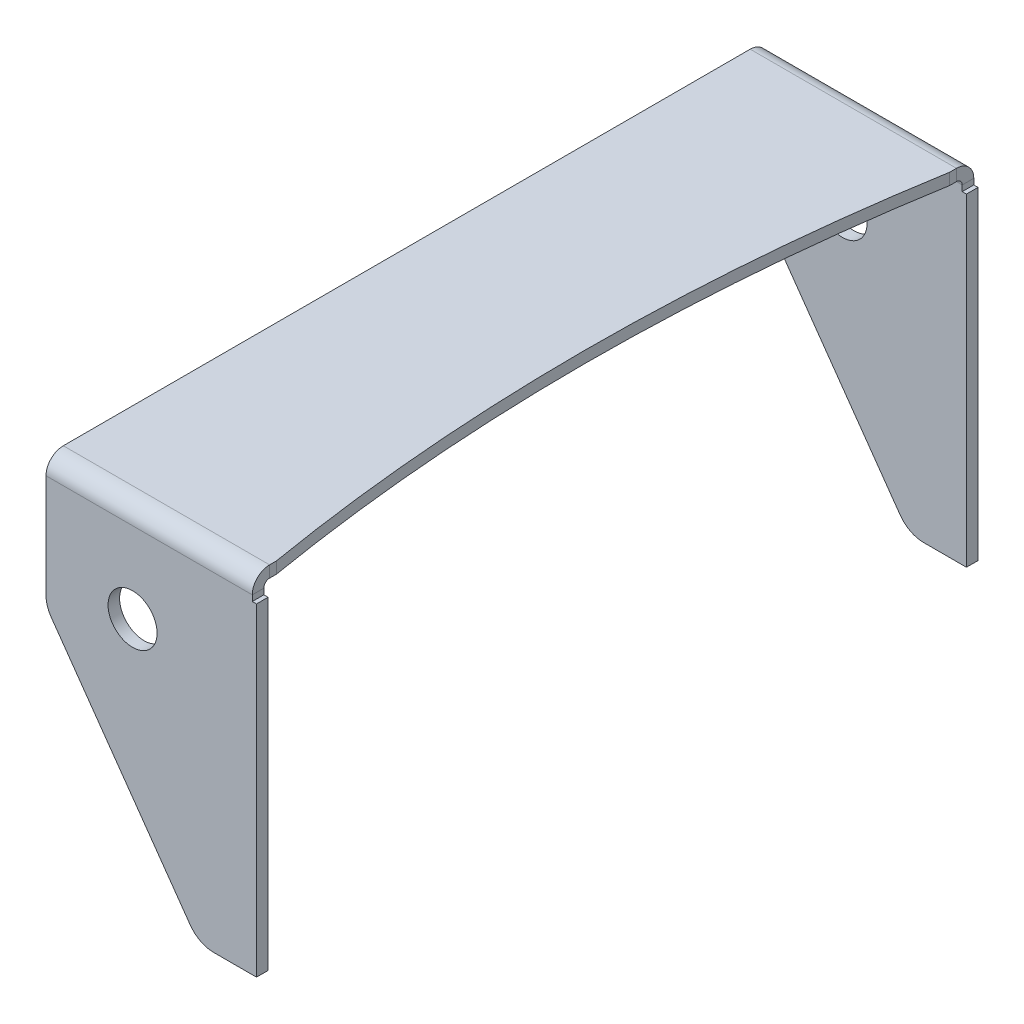
ISO-10303-21;
HEADER;
FILE_DESCRIPTION(('STEP AP214'),'2;1');
FILE_NAME('part.step','',(''),(''),'','','');
FILE_SCHEMA(('AUTOMOTIVE_DESIGN { 1 0 10303 214 1 1 1 1 }'));
ENDSEC;
DATA;
#1=APPLICATION_CONTEXT('core data for automotive mechanical design processes');
#2=APPLICATION_PROTOCOL_DEFINITION('international standard','automotive_design',2000,#1);
#3=PRODUCT_CONTEXT('',#1,'mechanical');
#4=PRODUCT('Part','Part','',(#3));
#5=PRODUCT_RELATED_PRODUCT_CATEGORY('part','',(#4));
#6=PRODUCT_DEFINITION_FORMATION('','',#4);
#7=PRODUCT_DEFINITION_CONTEXT('part definition',#1,'design');
#8=PRODUCT_DEFINITION('design','',#6,#7);
#9=PRODUCT_DEFINITION_SHAPE('','',#8);
#10=(LENGTH_UNIT() NAMED_UNIT(*) SI_UNIT(.MILLI.,.METRE.));
#11=(NAMED_UNIT(*) PLANE_ANGLE_UNIT() SI_UNIT($,.RADIAN.));
#12=(NAMED_UNIT(*) SI_UNIT($,.STERADIAN.) SOLID_ANGLE_UNIT());
#13=UNCERTAINTY_MEASURE_WITH_UNIT(LENGTH_MEASURE(1.E-05),#10,'distance_accuracy_value','');
#14=(GEOMETRIC_REPRESENTATION_CONTEXT(3) GLOBAL_UNCERTAINTY_ASSIGNED_CONTEXT((#13)) GLOBAL_UNIT_ASSIGNED_CONTEXT((#10,
#11,#12)) REPRESENTATION_CONTEXT('',''));
#15=CARTESIAN_POINT('',(0.,0.,0.));
#16=DIRECTION('',(0.,0.,1.));
#17=DIRECTION('',(1.,0.,0.));
#18=AXIS2_PLACEMENT_3D('',#15,#16,#17);
#19=CARTESIAN_POINT('',(-688.748865697796,4.44089209850063E-13,-121.000000000011));
#20=DIRECTION('',(-1.,0.,0.));
#21=DIRECTION('',(0.,1.,0.));
#22=AXIS2_PLACEMENT_3D('',#19,#20,#21);
#23=PLANE('',#22);
#24=DIRECTION('',(0.,-1.,0.));
#25=VECTOR('',#24,1.);
#26=CARTESIAN_POINT('',(-688.748865697796,4.44089209850063E-13,-125.000000000011));
#27=LINE('',#26,#25);
#28=CARTESIAN_POINT('',(-688.748865697796,3074.69999999999,-125.));
#29=VERTEX_POINT('',#28);
#30=CARTESIAN_POINT('',(-688.748865697796,2962.69999999999,-125.000000000001));
#31=VERTEX_POINT('',#30);
#32=EDGE_CURVE('E250',#29,#31,#27,.T.);
#33=ORIENTED_EDGE('',*,*,#32,.F.);
#34=DIRECTION('',(0.,0.,1.));
#35=VECTOR('',#34,1.);
#36=CARTESIAN_POINT('',(-688.748865697796,3074.69999999999,-121.));
#37=LINE('',#36,#35);
#38=CARTESIAN_POINT('',(-688.748865697796,3074.69999999999,-121.));
#39=VERTEX_POINT('',#38);
#40=EDGE_CURVE('E11',#39,#29,#37,.F.);
#41=ORIENTED_EDGE('',*,*,#40,.F.);
#42=DIRECTION('',(0.,1.,0.));
#43=VECTOR('',#42,1.);
#44=CARTESIAN_POINT('',(-688.748865697796,4.44089209850063E-13,-121.000000000011));
#45=LINE('',#44,#43);
#46=CARTESIAN_POINT('',(-688.748865697796,2962.69999999999,-121.000000000001));
#47=VERTEX_POINT('',#46);
#48=EDGE_CURVE('E247',#39,#47,#45,.F.);
#49=ORIENTED_EDGE('',*,*,#48,.T.);
#50=DIRECTION('',(0.,0.,1.));
#51=VECTOR('',#50,1.);
#52=CARTESIAN_POINT('',(-688.748865697796,2962.69999999999,-121.000000000001));
#53=LINE('',#52,#51);
#54=EDGE_CURVE('E420',#31,#47,#53,.T.);
#55=ORIENTED_EDGE('',*,*,#54,.F.);
#56=EDGE_LOOP('',(#33,#41,#49,#55));
#57=FACE_BOUND('',#56,.T.);
#58=ADVANCED_FACE('F41',(#57),#23,.F.);
#59=CARTESIAN_POINT('',(0.,4.44089209850063E-13,-121.000000000011));
#60=DIRECTION('',(0.,0.,-1.));
#61=DIRECTION('',(0.,-1.,0.));
#62=AXIS2_PLACEMENT_3D('',#59,#60,#61);
#63=PLANE('',#62);
#64=CARTESIAN_POINT('',(-731.685361366055,3048.69999999999,-121.));
#65=DIRECTION('',(0.,0.,1.));
#66=DIRECTION('',(0.,-1.,0.));
#67=AXIS2_PLACEMENT_3D('',#64,#65,#66);
#68=CIRCLE('',#67,8.49999999999994);
#69=CARTESIAN_POINT('',(-731.685361366055,3040.19999999999,-121.));
#70=VERTEX_POINT('',#69);
#71=EDGE_CURVE('E299',#70,#70,#68,.T.);
#72=ORIENTED_EDGE('',*,*,#71,.F.);
#73=EDGE_LOOP('',(#72));
#74=FACE_BOUND('',#73,.T.);
#75=ORIENTED_EDGE('',*,*,#48,.F.);
#76=DIRECTION('',(-1.,0.,0.));
#77=VECTOR('',#76,1.);
#78=CARTESIAN_POINT('',(0.,3074.69999999999,-121.));
#79=LINE('',#78,#77);
#80=CARTESIAN_POINT('',(-690.210843637587,3074.69999999999,-121.));
#81=VERTEX_POINT('',#80);
#82=EDGE_CURVE('E249',#39,#81,#79,.T.);
#83=ORIENTED_EDGE('',*,*,#82,.T.);
#84=DIRECTION('',(0.,1.,0.));
#85=VECTOR('',#84,1.);
#86=CARTESIAN_POINT('',(-690.210843637587,4.44089209850063E-13,-121.000000000011));
#87=LINE('',#86,#85);
#88=CARTESIAN_POINT('',(-690.210843637587,3076.69999999999,-121.));
#89=VERTEX_POINT('',#88);
#90=EDGE_CURVE('E325',#81,#89,#87,.T.);
#91=ORIENTED_EDGE('',*,*,#90,.T.);
#92=DIRECTION('',(1.,0.,0.));
#93=VECTOR('',#92,1.);
#94=CARTESIAN_POINT('',(-688.748865697796,3076.69999999999,-121.));
#95=LINE('',#94,#93);
#96=CARTESIAN_POINT('',(-761.685361366055,3076.69999999999,-121.));
#97=VERTEX_POINT('',#96);
#98=EDGE_CURVE('E45',#89,#97,#95,.F.);
#99=ORIENTED_EDGE('',*,*,#98,.T.);
#100=DIRECTION('',(0.,-1.,0.));
#101=VECTOR('',#100,1.);
#102=CARTESIAN_POINT('',(-761.685361366057,1.33226762955019E-12,-121.000000000011));
#103=LINE('',#102,#101);
#104=CARTESIAN_POINT('',(-761.685361366055,3040.87364744379,-121.));
#105=VERTEX_POINT('',#104);
#106=EDGE_CURVE('E223',#105,#97,#103,.F.);
#107=ORIENTED_EDGE('',*,*,#106,.F.);
#108=CARTESIAN_POINT('',(-751.685361366055,3040.87364744379,-121.));
#109=DIRECTION('',(0.,0.,-1.));
#110=DIRECTION('',(0.,1.,0.));
#111=AXIS2_PLACEMENT_3D('',#108,#109,#110);
#112=CIRCLE('',#111,10.);
#113=CARTESIAN_POINT('',(-759.855280217084,3035.10715579223,-121.));
#114=VERTEX_POINT('',#113);
#115=EDGE_CURVE('E222',#105,#114,#112,.F.);
#116=ORIENTED_EDGE('',*,*,#115,.T.);
#117=DIRECTION('',(-0.576649165156725,0.816991885102938,0.));
#118=VECTOR('',#117,1.);
#119=CARTESIAN_POINT('',(922.707701837343,651.265496818423,-121.000000000009));
#120=LINE('',#119,#118);
#121=CARTESIAN_POINT('',(-711.736960315773,2966.93350834842,-121.000000000001));
#122=VERTEX_POINT('',#121);
#123=EDGE_CURVE('E309',#122,#114,#120,.T.);
#124=ORIENTED_EDGE('',*,*,#123,.F.);
#125=CARTESIAN_POINT('',(-703.567041464744,2972.69999999999,-121.000000000001));
#126=DIRECTION('',(0.,0.,-1.));
#127=DIRECTION('',(0.,1.,0.));
#128=AXIS2_PLACEMENT_3D('',#125,#126,#127);
#129=CIRCLE('',#128,10.);
#130=CARTESIAN_POINT('',(-703.567041464744,2962.69999999999,-121.000000000001));
#131=VERTEX_POINT('',#130);
#132=EDGE_CURVE('E393',#122,#131,#129,.F.);
#133=ORIENTED_EDGE('',*,*,#132,.T.);
#134=DIRECTION('',(1.,0.,0.));
#135=VECTOR('',#134,1.);
#136=CARTESIAN_POINT('',(0.,2962.69999999999,-121.000000000001));
#137=LINE('',#136,#135);
#138=EDGE_CURVE('E304',#47,#131,#137,.F.);
#139=ORIENTED_EDGE('',*,*,#138,.F.);
#140=EDGE_LOOP('',(#75,#83,#91,#99,#107,#116,#124,#133,#139));
#141=FACE_BOUND('',#140,.T.);
#142=ADVANCED_FACE('F510',(#74,#141),#63,.F.);
#143=CARTESIAN_POINT('',(0.,4.44089209850063E-13,-125.000000000011));
#144=DIRECTION('',(0.,0.,-1.));
#145=DIRECTION('',(0.,-1.,0.));
#146=AXIS2_PLACEMENT_3D('',#143,#144,#145);
#147=PLANE('',#146);
#148=CARTESIAN_POINT('',(-731.685361366055,3048.69999999999,-125.));
#149=DIRECTION('',(0.,0.,1.));
#150=DIRECTION('',(0.,-1.,0.));
#151=AXIS2_PLACEMENT_3D('',#148,#149,#150);
#152=CIRCLE('',#151,8.49999999999994);
#153=CARTESIAN_POINT('',(-731.685361366055,3040.19999999999,-125.));
#154=VERTEX_POINT('',#153);
#155=EDGE_CURVE('E391',#154,#154,#152,.T.);
#156=ORIENTED_EDGE('',*,*,#155,.T.);
#157=EDGE_LOOP('',(#156));
#158=FACE_BOUND('',#157,.T.);
#159=DIRECTION('',(0.,-1.,0.));
#160=VECTOR('',#159,1.);
#161=CARTESIAN_POINT('',(-690.210843637587,4.44089209850063E-13,-125.000000000011));
#162=LINE('',#161,#160);
#163=CARTESIAN_POINT('',(-690.210843637587,3074.69999999999,-125.));
#164=VERTEX_POINT('',#163);
#165=CARTESIAN_POINT('',(-690.210843637587,3076.69999999999,-125.));
#166=VERTEX_POINT('',#165);
#167=EDGE_CURVE('E348',#164,#166,#162,.F.);
#168=ORIENTED_EDGE('',*,*,#167,.F.);
#169=DIRECTION('',(-1.,0.,0.));
#170=VECTOR('',#169,1.);
#171=CARTESIAN_POINT('',(0.,3074.69999999999,-125.));
#172=LINE('',#171,#170);
#173=EDGE_CURVE('E253',#164,#29,#172,.F.);
#174=ORIENTED_EDGE('',*,*,#173,.T.);
#175=ORIENTED_EDGE('',*,*,#32,.T.);
#176=DIRECTION('',(-1.,0.,0.));
#177=VECTOR('',#176,1.);
#178=CARTESIAN_POINT('',(0.,2962.69999999999,-125.000000000001));
#179=LINE('',#178,#177);
#180=CARTESIAN_POINT('',(-703.567041464744,2962.69999999999,-125.000000000001));
#181=VERTEX_POINT('',#180);
#182=EDGE_CURVE('E252',#31,#181,#179,.T.);
#183=ORIENTED_EDGE('',*,*,#182,.T.);
#184=CARTESIAN_POINT('',(-703.567041464744,2972.69999999999,-125.000000000001));
#185=DIRECTION('',(0.,0.,-1.));
#186=DIRECTION('',(0.,1.,0.));
#187=AXIS2_PLACEMENT_3D('',#184,#185,#186);
#188=CIRCLE('',#187,10.);
#189=CARTESIAN_POINT('',(-711.736960315773,2966.93350834842,-125.000000000001));
#190=VERTEX_POINT('',#189);
#191=EDGE_CURVE('E232',#181,#190,#188,.T.);
#192=ORIENTED_EDGE('',*,*,#191,.T.);
#193=DIRECTION('',(-0.576649165156725,0.816991885102938,0.));
#194=VECTOR('',#193,1.);
#195=CARTESIAN_POINT('',(922.707701837343,651.265496818423,-125.000000000009));
#196=LINE('',#195,#194);
#197=CARTESIAN_POINT('',(-759.855280217084,3035.10715579223,-125.));
#198=VERTEX_POINT('',#197);
#199=EDGE_CURVE('E206',#190,#198,#196,.T.);
#200=ORIENTED_EDGE('',*,*,#199,.T.);
#201=CARTESIAN_POINT('',(-751.685361366055,3040.87364744379,-125.));
#202=DIRECTION('',(0.,0.,-1.));
#203=DIRECTION('',(0.,1.,0.));
#204=AXIS2_PLACEMENT_3D('',#201,#202,#203);
#205=CIRCLE('',#204,10.);
#206=CARTESIAN_POINT('',(-761.685361366055,3040.87364744379,-125.));
#207=VERTEX_POINT('',#206);
#208=EDGE_CURVE('E198',#198,#207,#205,.T.);
#209=ORIENTED_EDGE('',*,*,#208,.T.);
#210=DIRECTION('',(0.,-1.,0.));
#211=VECTOR('',#210,1.);
#212=CARTESIAN_POINT('',(-761.685361366055,4.44089209850063E-13,-125.000000000011));
#213=LINE('',#212,#211);
#214=CARTESIAN_POINT('',(-761.685361366055,3076.69999999999,-125.));
#215=VERTEX_POINT('',#214);
#216=EDGE_CURVE('E203',#207,#215,#213,.F.);
#217=ORIENTED_EDGE('',*,*,#216,.T.);
#218=DIRECTION('',(-1.,0.,0.));
#219=VECTOR('',#218,1.);
#220=CARTESIAN_POINT('',(0.,3076.69999999999,-125.));
#221=LINE('',#220,#219);
#222=EDGE_CURVE('E315',#166,#215,#221,.T.);
#223=ORIENTED_EDGE('',*,*,#222,.F.);
#224=EDGE_LOOP('',(#168,#174,#175,#183,#192,#200,#209,#217,#223));
#225=FACE_BOUND('',#224,.T.);
#226=ADVANCED_FACE('F201',(#158,#225),#147,.T.);
#227=CARTESIAN_POINT('',(-688.748865697796,4.44089209850063E-13,121.000000000011));
#228=DIRECTION('',(1.,0.,0.));
#229=DIRECTION('',(0.,1.,0.));
#230=AXIS2_PLACEMENT_3D('',#227,#228,#229);
#231=PLANE('',#230);
#232=DIRECTION('',(0.,1.,0.));
#233=VECTOR('',#232,1.);
#234=CARTESIAN_POINT('',(-688.748865697796,4.44089209850063E-13,121.000000000011));
#235=LINE('',#234,#233);
#236=CARTESIAN_POINT('',(-688.748865697796,3074.69999999999,121.));
#237=VERTEX_POINT('',#236);
#238=CARTESIAN_POINT('',(-688.748865697796,2962.69999999999,121.000000000001));
#239=VERTEX_POINT('',#238);
#240=EDGE_CURVE('E236',#237,#239,#235,.F.);
#241=ORIENTED_EDGE('',*,*,#240,.F.);
#242=DIRECTION('',(0.,0.,1.));
#243=VECTOR('',#242,1.);
#244=CARTESIAN_POINT('',(-688.748865697796,3074.69999999999,125.));
#245=LINE('',#244,#243);
#246=CARTESIAN_POINT('',(-688.748865697796,3074.69999999999,125.));
#247=VERTEX_POINT('',#246);
#248=EDGE_CURVE('E51',#247,#237,#245,.F.);
#249=ORIENTED_EDGE('',*,*,#248,.F.);
#250=DIRECTION('',(0.,-1.,0.));
#251=VECTOR('',#250,1.);
#252=CARTESIAN_POINT('',(-688.748865697796,4.44089209850063E-13,125.000000000011));
#253=LINE('',#252,#251);
#254=CARTESIAN_POINT('',(-688.748865697796,2962.69999999999,125.000000000001));
#255=VERTEX_POINT('',#254);
#256=EDGE_CURVE('E219',#247,#255,#253,.T.);
#257=ORIENTED_EDGE('',*,*,#256,.T.);
#258=DIRECTION('',(0.,0.,-1.));
#259=VECTOR('',#258,1.);
#260=CARTESIAN_POINT('',(-688.748865697796,2962.69999999999,121.000000000001));
#261=LINE('',#260,#259);
#262=EDGE_CURVE('E235',#255,#239,#261,.T.);
#263=ORIENTED_EDGE('',*,*,#262,.T.);
#264=EDGE_LOOP('',(#241,#249,#257,#263));
#265=FACE_BOUND('',#264,.T.);
#266=ADVANCED_FACE('F556',(#265),#231,.T.);
#267=CARTESIAN_POINT('',(0.,4.44089209850063E-13,121.000000000011));
#268=DIRECTION('',(0.,0.,1.));
#269=DIRECTION('',(0.,-1.,0.));
#270=AXIS2_PLACEMENT_3D('',#267,#268,#269);
#271=PLANE('',#270);
#272=CARTESIAN_POINT('',(-731.685361366055,3048.69999999999,121.));
#273=DIRECTION('',(0.,0.,1.));
#274=DIRECTION('',(0.,-1.,0.));
#275=AXIS2_PLACEMENT_3D('',#272,#273,#274);
#276=CIRCLE('',#275,8.49999999999994);
#277=CARTESIAN_POINT('',(-731.685361366055,3040.19999999999,121.));
#278=VERTEX_POINT('',#277);
#279=EDGE_CURVE('E283',#278,#278,#276,.T.);
#280=ORIENTED_EDGE('',*,*,#279,.T.);
#281=EDGE_LOOP('',(#280));
#282=FACE_BOUND('',#281,.T.);
#283=DIRECTION('',(1.,0.,0.));
#284=VECTOR('',#283,1.);
#285=CARTESIAN_POINT('',(0.,3074.69999999999,121.));
#286=LINE('',#285,#284);
#287=CARTESIAN_POINT('',(-690.210843637587,3074.69999999999,121.));
#288=VERTEX_POINT('',#287);
#289=EDGE_CURVE('E262',#288,#237,#286,.T.);
#290=ORIENTED_EDGE('',*,*,#289,.T.);
#291=ORIENTED_EDGE('',*,*,#240,.T.);
#292=DIRECTION('',(1.,0.,0.));
#293=VECTOR('',#292,1.);
#294=CARTESIAN_POINT('',(0.,2962.69999999999,121.000000000001));
#295=LINE('',#294,#293);
#296=CARTESIAN_POINT('',(-703.567041464744,2962.69999999999,121.000000000001));
#297=VERTEX_POINT('',#296);
#298=EDGE_CURVE('E286',#239,#297,#295,.F.);
#299=ORIENTED_EDGE('',*,*,#298,.T.);
#300=CARTESIAN_POINT('',(-703.567041464744,2972.69999999999,121.));
#301=DIRECTION('',(0.,0.,1.));
#302=DIRECTION('',(0.,-1.,0.));
#303=AXIS2_PLACEMENT_3D('',#300,#301,#302);
#304=CIRCLE('',#303,10.);
#305=CARTESIAN_POINT('',(-711.736960315773,2966.93350834842,121.000000000001));
#306=VERTEX_POINT('',#305);
#307=EDGE_CURVE('E289',#297,#306,#304,.F.);
#308=ORIENTED_EDGE('',*,*,#307,.T.);
#309=DIRECTION('',(-0.576649165156725,0.816991885102938,0.));
#310=VECTOR('',#309,1.);
#311=CARTESIAN_POINT('',(922.707701837343,651.265496818423,121.000000000009));
#312=LINE('',#311,#310);
#313=CARTESIAN_POINT('',(-759.855280217084,3035.10715579223,121.));
#314=VERTEX_POINT('',#313);
#315=EDGE_CURVE('E290',#306,#314,#312,.T.);
#316=ORIENTED_EDGE('',*,*,#315,.T.);
#317=CARTESIAN_POINT('',(-751.685361366055,3040.87364744379,121.));
#318=DIRECTION('',(0.,0.,1.));
#319=DIRECTION('',(0.,-1.,0.));
#320=AXIS2_PLACEMENT_3D('',#317,#318,#319);
#321=CIRCLE('',#320,10.);
#322=CARTESIAN_POINT('',(-761.685361366055,3040.87364744379,121.));
#323=VERTEX_POINT('',#322);
#324=EDGE_CURVE('E293',#314,#323,#321,.F.);
#325=ORIENTED_EDGE('',*,*,#324,.T.);
#326=DIRECTION('',(0.,-1.,0.));
#327=VECTOR('',#326,1.);
#328=CARTESIAN_POINT('',(-761.685361366057,1.33226762955019E-12,121.000000000011));
#329=LINE('',#328,#327);
#330=CARTESIAN_POINT('',(-761.685361366055,3076.69999999999,121.));
#331=VERTEX_POINT('',#330);
#332=EDGE_CURVE('E294',#323,#331,#329,.F.);
#333=ORIENTED_EDGE('',*,*,#332,.T.);
#334=DIRECTION('',(1.,0.,0.));
#335=VECTOR('',#334,1.);
#336=CARTESIAN_POINT('',(-688.748865697796,3076.69999999999,121.));
#337=LINE('',#336,#335);
#338=CARTESIAN_POINT('',(-690.210843637587,3076.69999999999,121.));
#339=VERTEX_POINT('',#338);
#340=EDGE_CURVE('E254',#339,#331,#337,.F.);
#341=ORIENTED_EDGE('',*,*,#340,.F.);
#342=DIRECTION('',(0.,-1.,0.));
#343=VECTOR('',#342,1.);
#344=CARTESIAN_POINT('',(-690.210843637587,4.44089209850063E-13,121.000000000011));
#345=LINE('',#344,#343);
#346=EDGE_CURVE('E296',#339,#288,#345,.T.);
#347=ORIENTED_EDGE('',*,*,#346,.T.);
#348=EDGE_LOOP('',(#290,#291,#299,#308,#316,#325,#333,#341,#347));
#349=FACE_BOUND('',#348,.T.);
#350=ADVANCED_FACE('F558',(#282,#349),#271,.F.);
#351=CARTESIAN_POINT('',(0.,4.44089209850063E-13,125.000000000011));
#352=DIRECTION('',(0.,0.,1.));
#353=DIRECTION('',(0.,-1.,0.));
#354=AXIS2_PLACEMENT_3D('',#351,#352,#353);
#355=PLANE('',#354);
#356=CARTESIAN_POINT('',(-731.685361366055,3048.69999999999,125.));
#357=DIRECTION('',(0.,0.,1.));
#358=DIRECTION('',(0.,-1.,0.));
#359=AXIS2_PLACEMENT_3D('',#356,#357,#358);
#360=CIRCLE('',#359,8.49999999999994);
#361=CARTESIAN_POINT('',(-731.685361366055,3040.19999999999,125.));
#362=VERTEX_POINT('',#361);
#363=EDGE_CURVE('E303',#362,#362,#360,.T.);
#364=ORIENTED_EDGE('',*,*,#363,.F.);
#365=EDGE_LOOP('',(#364));
#366=FACE_BOUND('',#365,.T.);
#367=ORIENTED_EDGE('',*,*,#256,.F.);
#368=DIRECTION('',(-1.,0.,0.));
#369=VECTOR('',#368,1.);
#370=CARTESIAN_POINT('',(0.,3074.69999999999,125.));
#371=LINE('',#370,#369);
#372=CARTESIAN_POINT('',(-690.210843637587,3074.69999999999,125.));
#373=VERTEX_POINT('',#372);
#374=EDGE_CURVE('E259',#247,#373,#371,.T.);
#375=ORIENTED_EDGE('',*,*,#374,.T.);
#376=DIRECTION('',(0.,-1.,0.));
#377=VECTOR('',#376,1.);
#378=CARTESIAN_POINT('',(-690.210843637587,4.44089209850063E-13,125.000000000011));
#379=LINE('',#378,#377);
#380=CARTESIAN_POINT('',(-690.210843637587,3076.69999999999,125.));
#381=VERTEX_POINT('',#380);
#382=EDGE_CURVE('E377',#381,#373,#379,.T.);
#383=ORIENTED_EDGE('',*,*,#382,.F.);
#384=DIRECTION('',(-1.,0.,0.));
#385=VECTOR('',#384,1.);
#386=CARTESIAN_POINT('',(-761.685361366055,3076.69999999999,125.));
#387=LINE('',#386,#385);
#388=CARTESIAN_POINT('',(-761.685361366055,3076.69999999999,125.));
#389=VERTEX_POINT('',#388);
#390=EDGE_CURVE('E261',#381,#389,#387,.T.);
#391=ORIENTED_EDGE('',*,*,#390,.T.);
#392=DIRECTION('',(0.,-1.,0.));
#393=VECTOR('',#392,1.);
#394=CARTESIAN_POINT('',(-761.685361366055,4.44089209850063E-13,125.000000000011));
#395=LINE('',#394,#393);
#396=CARTESIAN_POINT('',(-761.685361366055,3040.87364744379,125.));
#397=VERTEX_POINT('',#396);
#398=EDGE_CURVE('E364',#397,#389,#395,.F.);
#399=ORIENTED_EDGE('',*,*,#398,.F.);
#400=CARTESIAN_POINT('',(-751.685361366055,3040.87364744379,125.));
#401=DIRECTION('',(0.,0.,1.));
#402=DIRECTION('',(0.,-1.,0.));
#403=AXIS2_PLACEMENT_3D('',#400,#401,#402);
#404=CIRCLE('',#403,10.);
#405=CARTESIAN_POINT('',(-759.855280217084,3035.10715579223,125.));
#406=VERTEX_POINT('',#405);
#407=EDGE_CURVE('E342',#397,#406,#404,.T.);
#408=ORIENTED_EDGE('',*,*,#407,.T.);
#409=DIRECTION('',(-0.576649165156725,0.816991885102938,0.));
#410=VECTOR('',#409,1.);
#411=CARTESIAN_POINT('',(922.707701837343,651.265496818423,125.000000000009));
#412=LINE('',#411,#410);
#413=CARTESIAN_POINT('',(-711.736960315773,2966.93350834842,125.000000000001));
#414=VERTEX_POINT('',#413);
#415=EDGE_CURVE('E367',#414,#406,#412,.T.);
#416=ORIENTED_EDGE('',*,*,#415,.F.);
#417=CARTESIAN_POINT('',(-703.567041464744,2972.69999999999,125.000000000001));
#418=DIRECTION('',(0.,0.,1.));
#419=DIRECTION('',(0.,-1.,0.));
#420=AXIS2_PLACEMENT_3D('',#417,#418,#419);
#421=CIRCLE('',#420,10.);
#422=CARTESIAN_POINT('',(-703.567041464744,2962.69999999999,125.000000000001));
#423=VERTEX_POINT('',#422);
#424=EDGE_CURVE('E412',#414,#423,#421,.T.);
#425=ORIENTED_EDGE('',*,*,#424,.T.);
#426=DIRECTION('',(1.,0.,0.));
#427=VECTOR('',#426,1.);
#428=CARTESIAN_POINT('',(0.,2962.69999999999,125.000000000001));
#429=LINE('',#428,#427);
#430=EDGE_CURVE('E372',#255,#423,#429,.F.);
#431=ORIENTED_EDGE('',*,*,#430,.F.);
#432=EDGE_LOOP('',(#367,#375,#383,#391,#399,#408,#416,#425,#431));
#433=FACE_BOUND('',#432,.T.);
#434=ADVANCED_FACE('F467',(#366,#433),#355,.T.);
#435=CARTESIAN_POINT('',(0.,3078.69999999999,0.));
#436=DIRECTION('',(0.,-1.,0.));
#437=DIRECTION('',(0.,0.,-1.));
#438=AXIS2_PLACEMENT_3D('',#435,#436,#437);
#439=CYLINDRICAL_SURFACE('',#438,700.);
#440=DIRECTION('',(0.,-1.,0.));
#441=VECTOR('',#440,1.);
#442=CARTESIAN_POINT('',(-690.210843637587,3078.69999999999,-116.657581515691));
#443=LINE('',#442,#441);
#444=CARTESIAN_POINT('',(-690.210843637587,3082.69999999999,-116.657581515691));
#445=VERTEX_POINT('',#444);
#446=CARTESIAN_POINT('',(-690.210843637587,3078.69999999999,-116.657581515691));
#447=VERTEX_POINT('',#446);
#448=EDGE_CURVE('E328',#445,#447,#443,.T.);
#449=ORIENTED_EDGE('',*,*,#448,.F.);
#450=CARTESIAN_POINT('',(0.,3082.69999999999,0.));
#451=DIRECTION('',(0.,-1.,0.));
#452=DIRECTION('',(0.,0.,-1.));
#453=AXIS2_PLACEMENT_3D('',#450,#451,#452);
#454=CIRCLE('',#453,700.);
#455=CARTESIAN_POINT('',(-690.210843637587,3082.69999999999,116.657581515691));
#456=VERTEX_POINT('',#455);
#457=EDGE_CURVE('E265',#456,#445,#454,.T.);
#458=ORIENTED_EDGE('',*,*,#457,.F.);
#459=DIRECTION('',(0.,-1.,0.));
#460=VECTOR('',#459,1.);
#461=CARTESIAN_POINT('',(-690.210843637587,3078.69999999999,116.657581515691));
#462=LINE('',#461,#460);
#463=CARTESIAN_POINT('',(-690.210843637587,3078.69999999999,116.657581515691));
#464=VERTEX_POINT('',#463);
#465=EDGE_CURVE('E282',#456,#464,#462,.T.);
#466=ORIENTED_EDGE('',*,*,#465,.T.);
#467=CARTESIAN_POINT('',(0.,3078.69999999999,0.));
#468=DIRECTION('',(0.,-1.,0.));
#469=DIRECTION('',(0.,0.,1.));
#470=AXIS2_PLACEMENT_3D('',#467,#468,#469);
#471=CIRCLE('',#470,700.);
#472=EDGE_CURVE('E278',#464,#447,#471,.T.);
#473=ORIENTED_EDGE('',*,*,#472,.T.);
#474=EDGE_LOOP('',(#449,#458,#466,#473));
#475=FACE_BOUND('',#474,.T.);
#476=ADVANCED_FACE('F442',(#475),#439,.F.);
#477=CARTESIAN_POINT('',(-690.210843637587,3078.69999999999,0.));
#478=DIRECTION('',(-1.,0.,0.));
#479=DIRECTION('',(0.,0.,1.));
#480=AXIS2_PLACEMENT_3D('',#477,#478,#479);
#481=PLANE('',#480);
#482=ORIENTED_EDGE('',*,*,#465,.F.);
#483=DIRECTION('',(0.,0.,1.));
#484=VECTOR('',#483,1.);
#485=CARTESIAN_POINT('',(-690.210843637587,3082.69999999999,0.));
#486=LINE('',#485,#484);
#487=CARTESIAN_POINT('',(-690.210843637587,3082.69999999999,119.));
#488=VERTEX_POINT('',#487);
#489=EDGE_CURVE('E281',#456,#488,#486,.T.);
#490=ORIENTED_EDGE('',*,*,#489,.T.);
#491=DIRECTION('',(0.,-1.,0.));
#492=VECTOR('',#491,1.);
#493=CARTESIAN_POINT('',(-690.210843637587,3078.69999999999,119.));
#494=LINE('',#493,#492);
#495=CARTESIAN_POINT('',(-690.210843637587,3078.69999999999,119.));
#496=VERTEX_POINT('',#495);
#497=EDGE_CURVE('E384',#488,#496,#494,.T.);
#498=ORIENTED_EDGE('',*,*,#497,.T.);
#499=DIRECTION('',(0.,0.,1.));
#500=VECTOR('',#499,1.);
#501=CARTESIAN_POINT('',(-690.210843637587,3078.69999999999,0.));
#502=LINE('',#501,#500);
#503=EDGE_CURVE('E312',#464,#496,#502,.T.);
#504=ORIENTED_EDGE('',*,*,#503,.F.);
#505=EDGE_LOOP('',(#482,#490,#498,#504));
#506=FACE_BOUND('',#505,.T.);
#507=ADVANCED_FACE('F450',(#506),#481,.F.);
#508=CARTESIAN_POINT('',(-690.210843637587,3076.69999999999,119.));
#509=DIRECTION('',(1.,0.,0.));
#510=DIRECTION('',(0.,0.,-1.));
#511=AXIS2_PLACEMENT_3D('',#508,#509,#510);
#512=PLANE('',#511);
#513=ORIENTED_EDGE('',*,*,#497,.F.);
#514=CARTESIAN_POINT('',(-690.210843637587,3076.69999999999,119.));
#515=DIRECTION('',(-1.,0.,0.));
#516=DIRECTION('',(0.,0.,1.));
#517=AXIS2_PLACEMENT_3D('',#514,#515,#516);
#518=CIRCLE('',#517,6.);
#519=EDGE_CURVE('E381',#488,#381,#518,.F.);
#520=ORIENTED_EDGE('',*,*,#519,.T.);
#521=DIRECTION('',(0.,0.,-1.));
#522=VECTOR('',#521,1.);
#523=CARTESIAN_POINT('',(-690.210843637587,3076.69999999999,121.));
#524=LINE('',#523,#522);
#525=EDGE_CURVE('E380',#381,#339,#524,.T.);
#526=ORIENTED_EDGE('',*,*,#525,.T.);
#527=CARTESIAN_POINT('',(-690.210843637587,3076.69999999999,119.));
#528=DIRECTION('',(-1.,0.,0.));
#529=DIRECTION('',(0.,0.,1.));
#530=AXIS2_PLACEMENT_3D('',#527,#528,#529);
#531=CIRCLE('',#530,2.);
#532=EDGE_CURVE('E258',#496,#339,#531,.F.);
#533=ORIENTED_EDGE('',*,*,#532,.F.);
#534=EDGE_LOOP('',(#513,#520,#526,#533));
#535=FACE_BOUND('',#534,.T.);
#536=ADVANCED_FACE('F452',(#535),#512,.T.);
#537=CARTESIAN_POINT('',(-690.210843637587,4.44089209850063E-13,121.000000000011));
#538=DIRECTION('',(-1.,0.,0.));
#539=DIRECTION('',(0.,-1.,0.));
#540=AXIS2_PLACEMENT_3D('',#537,#538,#539);
#541=PLANE('',#540);
#542=ORIENTED_EDGE('',*,*,#525,.F.);
#543=ORIENTED_EDGE('',*,*,#382,.T.);
#544=DIRECTION('',(0.,0.,-1.));
#545=VECTOR('',#544,1.);
#546=CARTESIAN_POINT('',(-690.210843637587,3074.69999999999,121.));
#547=LINE('',#546,#545);
#548=EDGE_CURVE('E376',#373,#288,#547,.T.);
#549=ORIENTED_EDGE('',*,*,#548,.T.);
#550=ORIENTED_EDGE('',*,*,#346,.F.);
#551=EDGE_LOOP('',(#542,#543,#549,#550));
#552=FACE_BOUND('',#551,.T.);
#553=ADVANCED_FACE('F470',(#552),#541,.F.);
#554=CARTESIAN_POINT('',(0.,3074.69999999999,121.));
#555=DIRECTION('',(0.,-1.,0.));
#556=DIRECTION('',(1.,0.,0.));
#557=AXIS2_PLACEMENT_3D('',#554,#555,#556);
#558=PLANE('',#557);
#559=ORIENTED_EDGE('',*,*,#548,.F.);
#560=ORIENTED_EDGE('',*,*,#374,.F.);
#561=ORIENTED_EDGE('',*,*,#248,.T.);
#562=ORIENTED_EDGE('',*,*,#289,.F.);
#563=EDGE_LOOP('',(#559,#560,#561,#562));
#564=FACE_BOUND('',#563,.T.);
#565=ADVANCED_FACE('F554',(#564),#558,.F.);
#566=CARTESIAN_POINT('',(0.,2962.69999999999,121.000000000001));
#567=DIRECTION('',(0.,-1.,0.));
#568=DIRECTION('',(1.,0.,0.));
#569=AXIS2_PLACEMENT_3D('',#566,#567,#568);
#570=PLANE('',#569);
#571=ORIENTED_EDGE('',*,*,#430,.T.);
#572=DIRECTION('',(0.,0.,1.));
#573=VECTOR('',#572,1.);
#574=CARTESIAN_POINT('',(-703.567041464744,2962.69999999999,121.000000000001));
#575=LINE('',#574,#573);
#576=EDGE_CURVE('E375',#423,#297,#575,.F.);
#577=ORIENTED_EDGE('',*,*,#576,.T.);
#578=ORIENTED_EDGE('',*,*,#298,.F.);
#579=ORIENTED_EDGE('',*,*,#262,.F.);
#580=EDGE_LOOP('',(#571,#577,#578,#579));
#581=FACE_BOUND('',#580,.T.);
#582=ADVANCED_FACE('F550',(#581),#570,.T.);
#583=CARTESIAN_POINT('',(922.707701837343,651.265496818423,121.000000000009));
#584=DIRECTION('',(0.816991885102938,0.576649165156725,0.));
#585=DIRECTION('',(-0.576649165156725,0.816991885102938,0.));
#586=AXIS2_PLACEMENT_3D('',#583,#584,#585);
#587=PLANE('',#586);
#588=ORIENTED_EDGE('',*,*,#315,.F.);
#589=DIRECTION('',(0.,0.,-1.));
#590=VECTOR('',#589,1.);
#591=CARTESIAN_POINT('',(-711.736960315773,2966.93350834842,121.000000000001));
#592=LINE('',#591,#590);
#593=EDGE_CURVE('E371',#306,#414,#592,.F.);
#594=ORIENTED_EDGE('',*,*,#593,.T.);
#595=ORIENTED_EDGE('',*,*,#415,.T.);
#596=DIRECTION('',(0.,0.,-1.));
#597=VECTOR('',#596,1.);
#598=CARTESIAN_POINT('',(-759.855280217084,3035.10715579223,121.));
#599=LINE('',#598,#597);
#600=EDGE_CURVE('E370',#406,#314,#599,.T.);
#601=ORIENTED_EDGE('',*,*,#600,.T.);
#602=EDGE_LOOP('',(#588,#594,#595,#601));
#603=FACE_BOUND('',#602,.T.);
#604=ADVANCED_FACE('F546',(#603),#587,.F.);
#605=CARTESIAN_POINT('',(-761.685361366057,1.33226762955019E-12,121.000000000011));
#606=DIRECTION('',(-1.,0.,0.));
#607=DIRECTION('',(0.,-1.,0.));
#608=AXIS2_PLACEMENT_3D('',#605,#606,#607);
#609=PLANE('',#608);
#610=ORIENTED_EDGE('',*,*,#332,.F.);
#611=DIRECTION('',(0.,0.,1.));
#612=VECTOR('',#611,1.);
#613=CARTESIAN_POINT('',(-761.685361366055,3040.87364744379,121.));
#614=LINE('',#613,#612);
#615=EDGE_CURVE('E366',#323,#397,#614,.T.);
#616=ORIENTED_EDGE('',*,*,#615,.T.);
#617=ORIENTED_EDGE('',*,*,#398,.T.);
#618=DIRECTION('',(0.,0.,-1.));
#619=VECTOR('',#618,1.);
#620=CARTESIAN_POINT('',(-761.685361366055,3076.69999999999,121.));
#621=LINE('',#620,#619);
#622=EDGE_CURVE('E363',#389,#331,#621,.T.);
#623=ORIENTED_EDGE('',*,*,#622,.T.);
#624=EDGE_LOOP('',(#610,#616,#617,#623));
#625=FACE_BOUND('',#624,.T.);
#626=ADVANCED_FACE('F542',(#625),#609,.T.);
#627=CARTESIAN_POINT('',(-761.685361366055,3076.69999999999,119.));
#628=DIRECTION('',(1.,0.,0.));
#629=DIRECTION('',(0.,0.,-1.));
#630=AXIS2_PLACEMENT_3D('',#627,#628,#629);
#631=PLANE('',#630);
#632=ORIENTED_EDGE('',*,*,#622,.F.);
#633=CARTESIAN_POINT('',(-761.685361366055,3076.69999999999,119.));
#634=DIRECTION('',(-1.,0.,0.));
#635=DIRECTION('',(0.,0.,1.));
#636=AXIS2_PLACEMENT_3D('',#633,#634,#635);
#637=CIRCLE('',#636,6.);
#638=CARTESIAN_POINT('',(-761.685361366055,3082.69999999999,119.));
#639=VERTEX_POINT('',#638);
#640=EDGE_CURVE('E359',#389,#639,#637,.T.);
#641=ORIENTED_EDGE('',*,*,#640,.T.);
#642=DIRECTION('',(0.,-1.,0.));
#643=VECTOR('',#642,1.);
#644=CARTESIAN_POINT('',(-761.685361366055,3078.69999999999,119.));
#645=LINE('',#644,#643);
#646=CARTESIAN_POINT('',(-761.685361366055,3078.69999999999,119.));
#647=VERTEX_POINT('',#646);
#648=EDGE_CURVE('E362',#639,#647,#645,.T.);
#649=ORIENTED_EDGE('',*,*,#648,.T.);
#650=CARTESIAN_POINT('',(-761.685361366055,3076.69999999999,119.));
#651=DIRECTION('',(-1.,0.,0.));
#652=DIRECTION('',(0.,0.,1.));
#653=AXIS2_PLACEMENT_3D('',#650,#651,#652);
#654=CIRCLE('',#653,2.);
#655=EDGE_CURVE('E257',#331,#647,#654,.T.);
#656=ORIENTED_EDGE('',*,*,#655,.F.);
#657=EDGE_LOOP('',(#632,#641,#649,#656));
#658=FACE_BOUND('',#657,.T.);
#659=ADVANCED_FACE('F539',(#658),#631,.F.);
#660=CARTESIAN_POINT('',(-761.685361366055,3078.69999999999,125.));
#661=DIRECTION('',(-1.,0.,0.));
#662=DIRECTION('',(0.,0.,1.));
#663=AXIS2_PLACEMENT_3D('',#660,#661,#662);
#664=PLANE('',#663);
#665=ORIENTED_EDGE('',*,*,#648,.F.);
#666=DIRECTION('',(0.,0.,1.));
#667=VECTOR('',#666,1.);
#668=CARTESIAN_POINT('',(-761.685361366055,3082.69999999999,0.));
#669=LINE('',#668,#667);
#670=CARTESIAN_POINT('',(-761.685361366055,3082.69999999999,-119.));
#671=VERTEX_POINT('',#670);
#672=EDGE_CURVE('E336',#671,#639,#669,.T.);
#673=ORIENTED_EDGE('',*,*,#672,.F.);
#674=DIRECTION('',(0.,-1.,0.));
#675=VECTOR('',#674,1.);
#676=CARTESIAN_POINT('',(-761.685361366055,3078.69999999999,-119.));
#677=LINE('',#676,#675);
#678=CARTESIAN_POINT('',(-761.685361366055,3078.69999999999,-119.));
#679=VERTEX_POINT('',#678);
#680=EDGE_CURVE('E273',#671,#679,#677,.T.);
#681=ORIENTED_EDGE('',*,*,#680,.T.);
#682=DIRECTION('',(0.,0.,1.));
#683=VECTOR('',#682,1.);
#684=CARTESIAN_POINT('',(-761.685361366055,3078.69999999999,125.));
#685=LINE('',#684,#683);
#686=EDGE_CURVE('E270',#679,#647,#685,.T.);
#687=ORIENTED_EDGE('',*,*,#686,.T.);
#688=EDGE_LOOP('',(#665,#673,#681,#687));
#689=FACE_BOUND('',#688,.T.);
#690=ADVANCED_FACE('F536',(#689),#664,.T.);
#691=CARTESIAN_POINT('',(-761.685361366055,3076.69999999999,-119.));
#692=DIRECTION('',(-1.,0.,0.));
#693=DIRECTION('',(0.,0.,1.));
#694=AXIS2_PLACEMENT_3D('',#691,#692,#693);
#695=PLANE('',#694);
#696=ORIENTED_EDGE('',*,*,#680,.F.);
#697=CARTESIAN_POINT('',(-761.685361366055,3076.69999999999,-119.));
#698=DIRECTION('',(-1.,0.,0.));
#699=DIRECTION('',(0.,0.,1.));
#700=AXIS2_PLACEMENT_3D('',#697,#698,#699);
#701=CIRCLE('',#700,6.);
#702=EDGE_CURVE('E332',#215,#671,#701,.F.);
#703=ORIENTED_EDGE('',*,*,#702,.F.);
#704=DIRECTION('',(0.,0.,1.));
#705=VECTOR('',#704,1.);
#706=CARTESIAN_POINT('',(-761.685361366055,3076.69999999999,-121.));
#707=LINE('',#706,#705);
#708=EDGE_CURVE('E217',#215,#97,#707,.T.);
#709=ORIENTED_EDGE('',*,*,#708,.T.);
#710=CARTESIAN_POINT('',(-761.685361366055,3076.69999999999,-119.));
#711=DIRECTION('',(1.,0.,0.));
#712=DIRECTION('',(0.,0.,-1.));
#713=AXIS2_PLACEMENT_3D('',#710,#711,#712);
#714=CIRCLE('',#713,2.);
#715=EDGE_CURVE('E224',#97,#679,#714,.T.);
#716=ORIENTED_EDGE('',*,*,#715,.T.);
#717=EDGE_LOOP('',(#696,#703,#709,#716));
#718=FACE_BOUND('',#717,.T.);
#719=ADVANCED_FACE('F481',(#718),#695,.T.);
#720=CARTESIAN_POINT('',(-761.685361366057,1.33226762955019E-12,-121.000000000011));
#721=DIRECTION('',(1.,0.,0.));
#722=DIRECTION('',(0.,-1.,0.));
#723=AXIS2_PLACEMENT_3D('',#720,#721,#722);
#724=PLANE('',#723);
#725=ORIENTED_EDGE('',*,*,#216,.F.);
#726=DIRECTION('',(0.,0.,1.));
#727=VECTOR('',#726,1.);
#728=CARTESIAN_POINT('',(-761.685361366055,3040.87364744379,-121.));
#729=LINE('',#728,#727);
#730=EDGE_CURVE('E214',#207,#105,#729,.T.);
#731=ORIENTED_EDGE('',*,*,#730,.T.);
#732=ORIENTED_EDGE('',*,*,#106,.T.);
#733=ORIENTED_EDGE('',*,*,#708,.F.);
#734=EDGE_LOOP('',(#725,#731,#732,#733));
#735=FACE_BOUND('',#734,.T.);
#736=ADVANCED_FACE('F213',(#735),#724,.F.);
#737=CARTESIAN_POINT('',(922.707701837343,651.265496818423,-121.000000000009));
#738=DIRECTION('',(-0.816991885102938,-0.576649165156725,0.));
#739=DIRECTION('',(-0.576649165156725,0.816991885102938,0.));
#740=AXIS2_PLACEMENT_3D('',#737,#738,#739);
#741=PLANE('',#740);
#742=ORIENTED_EDGE('',*,*,#199,.F.);
#743=DIRECTION('',(0.,0.,-1.));
#744=VECTOR('',#743,1.);
#745=CARTESIAN_POINT('',(-711.736960315773,2966.93350834842,-121.000000000001));
#746=LINE('',#745,#744);
#747=EDGE_CURVE('E226',#190,#122,#746,.F.);
#748=ORIENTED_EDGE('',*,*,#747,.T.);
#749=ORIENTED_EDGE('',*,*,#123,.T.);
#750=DIRECTION('',(0.,0.,-1.));
#751=VECTOR('',#750,1.);
#752=CARTESIAN_POINT('',(-759.855280217084,3035.10715579223,-121.));
#753=LINE('',#752,#751);
#754=EDGE_CURVE('E307',#114,#198,#753,.T.);
#755=ORIENTED_EDGE('',*,*,#754,.T.);
#756=EDGE_LOOP('',(#742,#748,#749,#755));
#757=FACE_BOUND('',#756,.T.);
#758=ADVANCED_FACE('F528',(#757),#741,.T.);
#759=CARTESIAN_POINT('',(0.,2962.69999999999,-121.000000000001));
#760=DIRECTION('',(0.,1.,0.));
#761=DIRECTION('',(1.,0.,0.));
#762=AXIS2_PLACEMENT_3D('',#759,#760,#761);
#763=PLANE('',#762);
#764=ORIENTED_EDGE('',*,*,#138,.T.);
#765=DIRECTION('',(0.,0.,1.));
#766=VECTOR('',#765,1.);
#767=CARTESIAN_POINT('',(-703.567041464744,2962.69999999999,-121.000000000001));
#768=LINE('',#767,#766);
#769=EDGE_CURVE('E306',#131,#181,#768,.F.);
#770=ORIENTED_EDGE('',*,*,#769,.T.);
#771=ORIENTED_EDGE('',*,*,#182,.F.);
#772=ORIENTED_EDGE('',*,*,#54,.T.);
#773=EDGE_LOOP('',(#764,#770,#771,#772));
#774=FACE_BOUND('',#773,.T.);
#775=ADVANCED_FACE('F525',(#774),#763,.F.);
#776=CARTESIAN_POINT('',(0.,3074.69999999999,-121.));
#777=DIRECTION('',(0.,-1.,0.));
#778=DIRECTION('',(-1.,0.,0.));
#779=AXIS2_PLACEMENT_3D('',#776,#777,#778);
#780=PLANE('',#779);
#781=ORIENTED_EDGE('',*,*,#82,.F.);
#782=ORIENTED_EDGE('',*,*,#40,.T.);
#783=ORIENTED_EDGE('',*,*,#173,.F.);
#784=DIRECTION('',(0.,0.,1.));
#785=VECTOR('',#784,1.);
#786=CARTESIAN_POINT('',(-690.210843637587,3074.69999999999,-121.));
#787=LINE('',#786,#785);
#788=EDGE_CURVE('E351',#164,#81,#787,.T.);
#789=ORIENTED_EDGE('',*,*,#788,.T.);
#790=EDGE_LOOP('',(#781,#782,#783,#789));
#791=FACE_BOUND('',#790,.T.);
#792=ADVANCED_FACE('F523',(#791),#780,.F.);
#793=CARTESIAN_POINT('',(-690.210843637587,4.44089209850063E-13,-121.000000000011));
#794=DIRECTION('',(-1.,0.,0.));
#795=DIRECTION('',(0.,1.,0.));
#796=AXIS2_PLACEMENT_3D('',#793,#794,#795);
#797=PLANE('',#796);
#798=ORIENTED_EDGE('',*,*,#788,.F.);
#799=ORIENTED_EDGE('',*,*,#167,.T.);
#800=DIRECTION('',(0.,0.,1.));
#801=VECTOR('',#800,1.);
#802=CARTESIAN_POINT('',(-690.210843637587,3076.69999999999,-121.));
#803=LINE('',#802,#801);
#804=EDGE_CURVE('E347',#166,#89,#803,.T.);
#805=ORIENTED_EDGE('',*,*,#804,.T.);
#806=ORIENTED_EDGE('',*,*,#90,.F.);
#807=EDGE_LOOP('',(#798,#799,#805,#806));
#808=FACE_BOUND('',#807,.T.);
#809=ADVANCED_FACE('F493',(#808),#797,.F.);
#810=CARTESIAN_POINT('',(-690.210843637587,3076.69999999999,-119.));
#811=DIRECTION('',(1.,0.,0.));
#812=DIRECTION('',(0.,0.,-1.));
#813=AXIS2_PLACEMENT_3D('',#810,#811,#812);
#814=PLANE('',#813);
#815=ORIENTED_EDGE('',*,*,#804,.F.);
#816=CARTESIAN_POINT('',(-690.210843637587,3076.69999999999,-119.));
#817=DIRECTION('',(-1.,0.,0.));
#818=DIRECTION('',(0.,0.,1.));
#819=AXIS2_PLACEMENT_3D('',#816,#817,#818);
#820=CIRCLE('',#819,6.);
#821=CARTESIAN_POINT('',(-690.210843637587,3082.69999999999,-119.));
#822=VERTEX_POINT('',#821);
#823=EDGE_CURVE('E343',#166,#822,#820,.F.);
#824=ORIENTED_EDGE('',*,*,#823,.T.);
#825=DIRECTION('',(0.,-1.,0.));
#826=VECTOR('',#825,1.);
#827=CARTESIAN_POINT('',(-690.210843637587,3078.69999999999,-119.));
#828=LINE('',#827,#826);
#829=CARTESIAN_POINT('',(-690.210843637587,3078.69999999999,-119.));
#830=VERTEX_POINT('',#829);
#831=EDGE_CURVE('E346',#822,#830,#828,.T.);
#832=ORIENTED_EDGE('',*,*,#831,.T.);
#833=CARTESIAN_POINT('',(-690.210843637587,3076.69999999999,-119.));
#834=DIRECTION('',(-1.,0.,0.));
#835=DIRECTION('',(0.,0.,1.));
#836=AXIS2_PLACEMENT_3D('',#833,#834,#835);
#837=CIRCLE('',#836,2.);
#838=EDGE_CURVE('E269',#89,#830,#837,.F.);
#839=ORIENTED_EDGE('',*,*,#838,.F.);
#840=EDGE_LOOP('',(#815,#824,#832,#839));
#841=FACE_BOUND('',#840,.T.);
#842=ADVANCED_FACE('F487',(#841),#814,.T.);
#843=CARTESIAN_POINT('',(-731.685361366055,3048.69999999999,121.));
#844=DIRECTION('',(0.,0.,1.));
#845=DIRECTION('',(0.,-1.,0.));
#846=AXIS2_PLACEMENT_3D('',#843,#844,#845);
#847=CYLINDRICAL_SURFACE('',#846,8.49999999999994);
#848=ORIENTED_EDGE('',*,*,#279,.F.);
#849=EDGE_LOOP('',(#848));
#850=FACE_BOUND('',#849,.T.);
#851=ORIENTED_EDGE('',*,*,#363,.T.);
#852=EDGE_LOOP('',(#851));
#853=FACE_BOUND('',#852,.T.);
#854=ADVANCED_FACE('F505',(#850,#853),#847,.F.);
#855=CARTESIAN_POINT('',(-731.685361366055,3048.69999999999,-121.));
#856=DIRECTION('',(0.,0.,1.));
#857=DIRECTION('',(0.,-1.,0.));
#858=AXIS2_PLACEMENT_3D('',#855,#856,#857);
#859=CYLINDRICAL_SURFACE('',#858,8.49999999999994);
#860=ORIENTED_EDGE('',*,*,#71,.T.);
#861=EDGE_LOOP('',(#860));
#862=FACE_BOUND('',#861,.T.);
#863=ORIENTED_EDGE('',*,*,#155,.F.);
#864=EDGE_LOOP('',(#863));
#865=FACE_BOUND('',#864,.T.);
#866=ADVANCED_FACE('F498',(#862,#865),#859,.F.);
#867=CARTESIAN_POINT('',(-690.210843637587,3078.69999999999,0.));
#868=DIRECTION('',(-1.,0.,0.));
#869=DIRECTION('',(0.,0.,1.));
#870=AXIS2_PLACEMENT_3D('',#867,#868,#869);
#871=PLANE('',#870);
#872=DIRECTION('',(0.,0.,1.));
#873=VECTOR('',#872,1.);
#874=CARTESIAN_POINT('',(-690.210843637587,3082.69999999999,0.));
#875=LINE('',#874,#873);
#876=EDGE_CURVE('E302',#822,#445,#875,.T.);
#877=ORIENTED_EDGE('',*,*,#876,.T.);
#878=ORIENTED_EDGE('',*,*,#448,.T.);
#879=DIRECTION('',(0.,0.,1.));
#880=VECTOR('',#879,1.);
#881=CARTESIAN_POINT('',(-690.210843637587,3078.69999999999,0.));
#882=LINE('',#881,#880);
#883=EDGE_CURVE('E277',#830,#447,#882,.T.);
#884=ORIENTED_EDGE('',*,*,#883,.F.);
#885=ORIENTED_EDGE('',*,*,#831,.F.);
#886=EDGE_LOOP('',(#877,#878,#884,#885));
#887=FACE_BOUND('',#886,.T.);
#888=ADVANCED_FACE('F496',(#887),#871,.F.);
#889=CARTESIAN_POINT('',(-761.685361366055,3076.69999999999,-119.));
#890=DIRECTION('',(-1.,0.,0.));
#891=DIRECTION('',(0.,0.,-1.));
#892=AXIS2_PLACEMENT_3D('',#889,#890,#891);
#893=CYLINDRICAL_SURFACE('',#892,2.);
#894=ORIENTED_EDGE('',*,*,#98,.F.);
#895=ORIENTED_EDGE('',*,*,#838,.T.);
#896=DIRECTION('',(-1.,0.,0.));
#897=VECTOR('',#896,1.);
#898=CARTESIAN_POINT('',(-761.685361366055,3078.69999999999,-119.));
#899=LINE('',#898,#897);
#900=EDGE_CURVE('E274',#679,#830,#899,.F.);
#901=ORIENTED_EDGE('',*,*,#900,.F.);
#902=ORIENTED_EDGE('',*,*,#715,.F.);
#903=EDGE_LOOP('',(#894,#895,#901,#902));
#904=FACE_BOUND('',#903,.T.);
#905=ADVANCED_FACE('F486',(#904),#893,.F.);
#906=CARTESIAN_POINT('',(-761.685361366055,3076.69999999999,119.));
#907=DIRECTION('',(-1.,0.,0.));
#908=DIRECTION('',(0.,0.,1.));
#909=AXIS2_PLACEMENT_3D('',#906,#907,#908);
#910=CYLINDRICAL_SURFACE('',#909,2.);
#911=DIRECTION('',(-1.,0.,0.));
#912=VECTOR('',#911,1.);
#913=CARTESIAN_POINT('',(-761.685361366055,3078.69999999999,119.));
#914=LINE('',#913,#912);
#915=EDGE_CURVE('E266',#647,#496,#914,.F.);
#916=ORIENTED_EDGE('',*,*,#915,.T.);
#917=ORIENTED_EDGE('',*,*,#532,.T.);
#918=ORIENTED_EDGE('',*,*,#340,.T.);
#919=ORIENTED_EDGE('',*,*,#655,.T.);
#920=EDGE_LOOP('',(#916,#917,#918,#919));
#921=FACE_BOUND('',#920,.T.);
#922=ADVANCED_FACE('F474',(#921),#910,.F.);
#923=CARTESIAN_POINT('',(0.,3078.69999999999,0.));
#924=DIRECTION('',(0.,1.,0.));
#925=DIRECTION('',(0.,0.,1.));
#926=AXIS2_PLACEMENT_3D('',#923,#924,#925);
#927=PLANE('',#926);
#928=ORIENTED_EDGE('',*,*,#900,.T.);
#929=ORIENTED_EDGE('',*,*,#883,.T.);
#930=ORIENTED_EDGE('',*,*,#472,.F.);
#931=ORIENTED_EDGE('',*,*,#503,.T.);
#932=ORIENTED_EDGE('',*,*,#915,.F.);
#933=ORIENTED_EDGE('',*,*,#686,.F.);
#934=EDGE_LOOP('',(#928,#929,#930,#931,#932,#933));
#935=FACE_BOUND('',#934,.T.);
#936=ADVANCED_FACE('F447',(#935),#927,.F.);
#937=CARTESIAN_POINT('',(-761.685361366055,3076.69999999999,-119.));
#938=DIRECTION('',(-1.,0.,0.));
#939=DIRECTION('',(0.,0.,-1.));
#940=AXIS2_PLACEMENT_3D('',#937,#938,#939);
#941=CYLINDRICAL_SURFACE('',#940,6.);
#942=ORIENTED_EDGE('',*,*,#222,.T.);
#943=ORIENTED_EDGE('',*,*,#702,.T.);
#944=DIRECTION('',(1.,0.,0.));
#945=VECTOR('',#944,1.);
#946=CARTESIAN_POINT('',(0.,3082.69999999999,-119.));
#947=LINE('',#946,#945);
#948=EDGE_CURVE('E333',#671,#822,#947,.T.);
#949=ORIENTED_EDGE('',*,*,#948,.T.);
#950=ORIENTED_EDGE('',*,*,#823,.F.);
#951=EDGE_LOOP('',(#942,#943,#949,#950));
#952=FACE_BOUND('',#951,.T.);
#953=ADVANCED_FACE('F43',(#952),#941,.T.);
#954=CARTESIAN_POINT('',(-761.685361366055,3076.69999999999,119.));
#955=DIRECTION('',(-1.,0.,0.));
#956=DIRECTION('',(0.,0.,1.));
#957=AXIS2_PLACEMENT_3D('',#954,#955,#956);
#958=CYLINDRICAL_SURFACE('',#957,6.);
#959=DIRECTION('',(-1.,0.,0.));
#960=VECTOR('',#959,1.);
#961=CARTESIAN_POINT('',(-761.685361366055,3082.69999999999,119.));
#962=LINE('',#961,#960);
#963=EDGE_CURVE('E337',#639,#488,#962,.F.);
#964=ORIENTED_EDGE('',*,*,#963,.F.);
#965=ORIENTED_EDGE('',*,*,#640,.F.);
#966=ORIENTED_EDGE('',*,*,#390,.F.);
#967=ORIENTED_EDGE('',*,*,#519,.F.);
#968=EDGE_LOOP('',(#964,#965,#966,#967));
#969=FACE_BOUND('',#968,.T.);
#970=ADVANCED_FACE('F462',(#969),#958,.T.);
#971=CARTESIAN_POINT('',(0.,3082.69999999999,0.));
#972=DIRECTION('',(0.,1.,0.));
#973=DIRECTION('',(0.,0.,1.));
#974=AXIS2_PLACEMENT_3D('',#971,#972,#973);
#975=PLANE('',#974);
#976=ORIENTED_EDGE('',*,*,#948,.F.);
#977=ORIENTED_EDGE('',*,*,#672,.T.);
#978=ORIENTED_EDGE('',*,*,#963,.T.);
#979=ORIENTED_EDGE('',*,*,#489,.F.);
#980=ORIENTED_EDGE('',*,*,#457,.T.);
#981=ORIENTED_EDGE('',*,*,#876,.F.);
#982=EDGE_LOOP('',(#976,#977,#978,#979,#980,#981));
#983=FACE_BOUND('',#982,.T.);
#984=ADVANCED_FACE('F457',(#983),#975,.T.);
#985=CARTESIAN_POINT('',(-703.567041464744,2972.69999999999,121.));
#986=DIRECTION('',(0.,0.,1.));
#987=DIRECTION('',(0.,-1.,0.));
#988=AXIS2_PLACEMENT_3D('',#985,#986,#987);
#989=CYLINDRICAL_SURFACE('',#988,10.);
#990=ORIENTED_EDGE('',*,*,#424,.F.);
#991=ORIENTED_EDGE('',*,*,#593,.F.);
#992=ORIENTED_EDGE('',*,*,#307,.F.);
#993=ORIENTED_EDGE('',*,*,#576,.F.);
#994=EDGE_LOOP('',(#990,#991,#992,#993));
#995=FACE_BOUND('',#994,.T.);
#996=ADVANCED_FACE('F584',(#995),#989,.T.);
#997=CARTESIAN_POINT('',(-751.685361366055,3040.87364744379,121.));
#998=DIRECTION('',(0.,0.,1.));
#999=DIRECTION('',(0.,-1.,0.));
#1000=AXIS2_PLACEMENT_3D('',#997,#998,#999);
#1001=CYLINDRICAL_SURFACE('',#1000,10.);
#1002=ORIENTED_EDGE('',*,*,#407,.F.);
#1003=ORIENTED_EDGE('',*,*,#615,.F.);
#1004=ORIENTED_EDGE('',*,*,#324,.F.);
#1005=ORIENTED_EDGE('',*,*,#600,.F.);
#1006=EDGE_LOOP('',(#1002,#1003,#1004,#1005));
#1007=FACE_BOUND('',#1006,.T.);
#1008=ADVANCED_FACE('F600',(#1007),#1001,.T.);
#1009=CARTESIAN_POINT('',(-703.567041464744,2972.69999999999,-121.000000000001));
#1010=DIRECTION('',(0.,0.,-1.));
#1011=DIRECTION('',(0.,1.,0.));
#1012=AXIS2_PLACEMENT_3D('',#1009,#1010,#1011);
#1013=CYLINDRICAL_SURFACE('',#1012,10.);
#1014=ORIENTED_EDGE('',*,*,#191,.F.);
#1015=ORIENTED_EDGE('',*,*,#769,.F.);
#1016=ORIENTED_EDGE('',*,*,#132,.F.);
#1017=ORIENTED_EDGE('',*,*,#747,.F.);
#1018=EDGE_LOOP('',(#1014,#1015,#1016,#1017));
#1019=FACE_BOUND('',#1018,.T.);
#1020=ADVANCED_FACE('F597',(#1019),#1013,.T.);
#1021=CARTESIAN_POINT('',(-751.685361366055,3040.87364744379,-121.));
#1022=DIRECTION('',(0.,0.,-1.));
#1023=DIRECTION('',(0.,1.,0.));
#1024=AXIS2_PLACEMENT_3D('',#1021,#1022,#1023);
#1025=CYLINDRICAL_SURFACE('',#1024,10.);
#1026=ORIENTED_EDGE('',*,*,#208,.F.);
#1027=ORIENTED_EDGE('',*,*,#754,.F.);
#1028=ORIENTED_EDGE('',*,*,#115,.F.);
#1029=ORIENTED_EDGE('',*,*,#730,.F.);
#1030=EDGE_LOOP('',(#1026,#1027,#1028,#1029));
#1031=FACE_BOUND('',#1030,.T.);
#1032=ADVANCED_FACE('F221',(#1031),#1025,.T.);
#1033=CLOSED_SHELL('',(#58,#142,#226,#266,#350,#434,#476,#507,#536,#553,#565,#582,#604,#626,
#659,#690,#719,#736,#758,#775,#792,#809,#842,#854,#866,#888,#905,#922,#936,#953,#970,#984,#996,
#1008,#1020,#1032));
#1034=MANIFOLD_SOLID_BREP('B2',#1033);
#1035=ADVANCED_BREP_SHAPE_REPRESENTATION('',(#18,#1034),#14);
#1036=SHAPE_DEFINITION_REPRESENTATION(#9,#1035);
ENDSEC;
END-ISO-10303-21;
